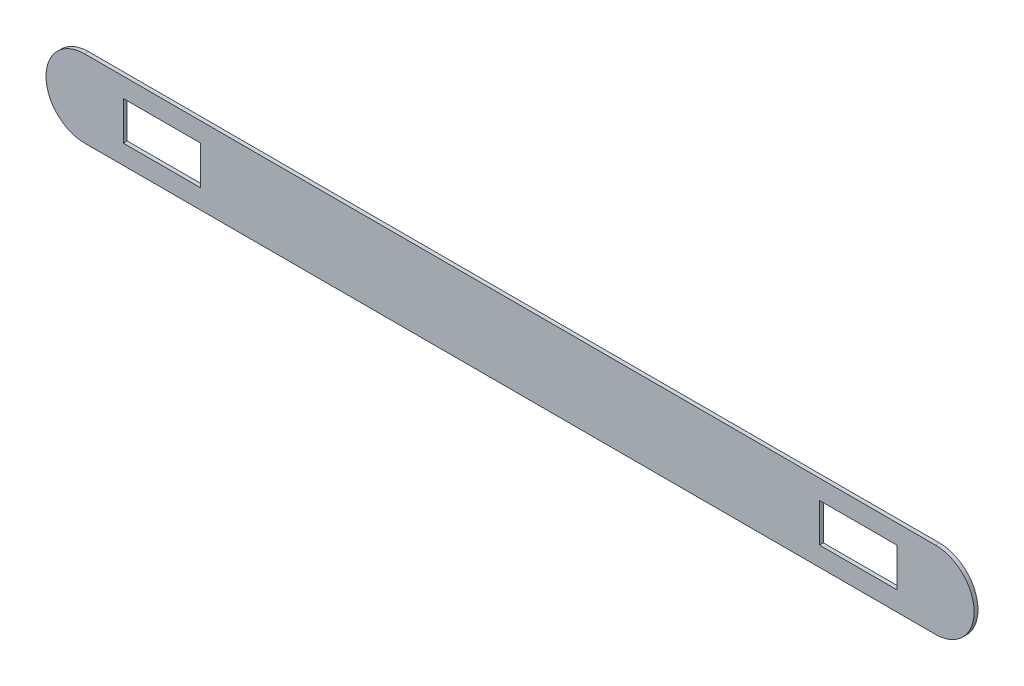
ISO-10303-21;
HEADER;
FILE_DESCRIPTION(('STEP AP214'),'2;1');
FILE_NAME('part.step','',(''),(''),'','','');
FILE_SCHEMA(('AUTOMOTIVE_DESIGN { 1 0 10303 214 1 1 1 1 }'));
ENDSEC;
DATA;
#1=APPLICATION_CONTEXT('core data for automotive mechanical design processes');
#2=APPLICATION_PROTOCOL_DEFINITION('international standard','automotive_design',2000,#1);
#3=PRODUCT_CONTEXT('',#1,'mechanical');
#4=PRODUCT('Part','Part','',(#3));
#5=PRODUCT_RELATED_PRODUCT_CATEGORY('part','',(#4));
#6=PRODUCT_DEFINITION_FORMATION('','',#4);
#7=PRODUCT_DEFINITION_CONTEXT('part definition',#1,'design');
#8=PRODUCT_DEFINITION('design','',#6,#7);
#9=PRODUCT_DEFINITION_SHAPE('','',#8);
#10=(LENGTH_UNIT() NAMED_UNIT(*) SI_UNIT(.MILLI.,.METRE.));
#11=(NAMED_UNIT(*) PLANE_ANGLE_UNIT() SI_UNIT($,.RADIAN.));
#12=(NAMED_UNIT(*) SI_UNIT($,.STERADIAN.) SOLID_ANGLE_UNIT());
#13=UNCERTAINTY_MEASURE_WITH_UNIT(LENGTH_MEASURE(1.E-05),#10,'distance_accuracy_value','');
#14=(GEOMETRIC_REPRESENTATION_CONTEXT(3) GLOBAL_UNCERTAINTY_ASSIGNED_CONTEXT((#13)) GLOBAL_UNIT_ASSIGNED_CONTEXT((#10,
#11,#12)) REPRESENTATION_CONTEXT('',''));
#15=CARTESIAN_POINT('',(0.,0.,0.));
#16=DIRECTION('',(0.,0.,1.));
#17=DIRECTION('',(1.,0.,0.));
#18=AXIS2_PLACEMENT_3D('',#15,#16,#17);
#19=CARTESIAN_POINT('',(-502.733741957931,0.,0.));
#20=DIRECTION('',(0.,0.,1.));
#21=DIRECTION('',(1.,0.,0.));
#22=AXIS2_PLACEMENT_3D('',#19,#20,#21);
#23=PLANE('',#22);
#24=DIRECTION('',(-1.,0.,0.));
#25=VECTOR('',#24,1.);
#26=CARTESIAN_POINT('',(-502.733741957931,25.,0.));
#27=LINE('',#26,#25);
#28=CARTESIAN_POINT('',(-352.733741957931,25.,0.));
#29=VERTEX_POINT('',#28);
#30=CARTESIAN_POINT('',(-452.733741957932,25.,0.));
#31=VERTEX_POINT('',#30);
#32=EDGE_CURVE('E185',#29,#31,#27,.T.);
#33=ORIENTED_EDGE('',*,*,#32,.T.);
#34=DIRECTION('',(0.,-1.,0.));
#35=VECTOR('',#34,1.);
#36=CARTESIAN_POINT('',(-452.733741957932,0.,0.));
#37=LINE('',#36,#35);
#38=CARTESIAN_POINT('',(-452.733741957932,-25.,0.));
#39=VERTEX_POINT('',#38);
#40=EDGE_CURVE('E188',#31,#39,#37,.T.);
#41=ORIENTED_EDGE('',*,*,#40,.T.);
#42=DIRECTION('',(1.,0.,0.));
#43=VECTOR('',#42,1.);
#44=CARTESIAN_POINT('',(-502.733741957931,-25.,0.));
#45=LINE('',#44,#43);
#46=CARTESIAN_POINT('',(-352.733741957931,-25.,0.));
#47=VERTEX_POINT('',#46);
#48=EDGE_CURVE('E182',#39,#47,#45,.T.);
#49=ORIENTED_EDGE('',*,*,#48,.T.);
#50=DIRECTION('',(0.,1.,0.));
#51=VECTOR('',#50,1.);
#52=CARTESIAN_POINT('',(-352.733741957931,0.,0.));
#53=LINE('',#52,#51);
#54=EDGE_CURVE('E127',#47,#29,#53,.T.);
#55=ORIENTED_EDGE('',*,*,#54,.T.);
#56=EDGE_LOOP('',(#33,#41,#49,#55));
#57=FACE_BOUND('',#56,.T.);
#58=DIRECTION('',(-1.,0.,0.));
#59=VECTOR('',#58,1.);
#60=CARTESIAN_POINT('',(-502.733741957931,25.0000000000004,0.));
#61=LINE('',#60,#59);
#62=CARTESIAN_POINT('',(547.266258042068,25.,0.));
#63=VERTEX_POINT('',#62);
#64=CARTESIAN_POINT('',(447.266258042068,25.,0.));
#65=VERTEX_POINT('',#64);
#66=EDGE_CURVE('E176',#63,#65,#61,.T.);
#67=ORIENTED_EDGE('',*,*,#66,.T.);
#68=DIRECTION('',(0.,-1.,0.));
#69=VECTOR('',#68,1.);
#70=CARTESIAN_POINT('',(447.266258042068,0.,0.));
#71=LINE('',#70,#69);
#72=CARTESIAN_POINT('',(447.266258042068,-25.,0.));
#73=VERTEX_POINT('',#72);
#74=EDGE_CURVE('E179',#65,#73,#71,.T.);
#75=ORIENTED_EDGE('',*,*,#74,.T.);
#76=DIRECTION('',(1.,0.,0.));
#77=VECTOR('',#76,1.);
#78=CARTESIAN_POINT('',(-502.733741957931,-25.,0.));
#79=LINE('',#78,#77);
#80=CARTESIAN_POINT('',(547.266258042068,-25.,0.));
#81=VERTEX_POINT('',#80);
#82=EDGE_CURVE('E150',#73,#81,#79,.T.);
#83=ORIENTED_EDGE('',*,*,#82,.T.);
#84=DIRECTION('',(0.,1.,0.));
#85=VECTOR('',#84,1.);
#86=CARTESIAN_POINT('',(547.266258042068,0.,0.));
#87=LINE('',#86,#85);
#88=EDGE_CURVE('E173',#81,#63,#87,.T.);
#89=ORIENTED_EDGE('',*,*,#88,.T.);
#90=EDGE_LOOP('',(#67,#75,#83,#89));
#91=FACE_BOUND('',#90,.T.);
#92=CARTESIAN_POINT('',(-502.733741957931,0.,0.));
#93=DIRECTION('',(0.,0.,1.));
#94=DIRECTION('',(1.,0.,0.));
#95=AXIS2_PLACEMENT_3D('',#92,#93,#94);
#96=CIRCLE('',#95,50.);
#97=CARTESIAN_POINT('',(-502.733741957931,50.,0.));
#98=VERTEX_POINT('',#97);
#99=CARTESIAN_POINT('',(-502.733741957931,-50.,0.));
#100=VERTEX_POINT('',#99);
#101=EDGE_CURVE('E212',#98,#100,#96,.T.);
#102=ORIENTED_EDGE('',*,*,#101,.F.);
#103=DIRECTION('',(-1.,0.,0.));
#104=VECTOR('',#103,1.);
#105=CARTESIAN_POINT('',(-502.733741957931,50.,0.));
#106=LINE('',#105,#104);
#107=CARTESIAN_POINT('',(597.266258042068,50.,0.));
#108=VERTEX_POINT('',#107);
#109=EDGE_CURVE('E197',#108,#98,#106,.T.);
#110=ORIENTED_EDGE('',*,*,#109,.F.);
#111=CARTESIAN_POINT('',(597.266258042068,0.,0.));
#112=DIRECTION('',(0.,0.,1.));
#113=DIRECTION('',(1.,0.,0.));
#114=AXIS2_PLACEMENT_3D('',#111,#112,#113);
#115=CIRCLE('',#114,50.);
#116=CARTESIAN_POINT('',(597.266258042068,-50.,0.));
#117=VERTEX_POINT('',#116);
#118=EDGE_CURVE('E206',#117,#108,#115,.T.);
#119=ORIENTED_EDGE('',*,*,#118,.F.);
#120=DIRECTION('',(1.,0.,0.));
#121=VECTOR('',#120,1.);
#122=CARTESIAN_POINT('',(-502.733741957931,-50.,0.));
#123=LINE('',#122,#121);
#124=EDGE_CURVE('E11',#100,#117,#123,.T.);
#125=ORIENTED_EDGE('',*,*,#124,.F.);
#126=EDGE_LOOP('',(#102,#110,#119,#125));
#127=FACE_BOUND('',#126,.T.);
#128=ADVANCED_FACE('F32',(#57,#91,#127),#23,.F.);
#129=CARTESIAN_POINT('',(-502.733741957931,-50.,80.));
#130=DIRECTION('',(0.,1.,0.));
#131=DIRECTION('',(0.,0.,1.));
#132=AXIS2_PLACEMENT_3D('',#129,#130,#131);
#133=PLANE('',#132);
#134=DIRECTION('',(0.,0.,-1.));
#135=VECTOR('',#134,1.);
#136=CARTESIAN_POINT('',(597.266258042068,-50.,80.));
#137=LINE('',#136,#135);
#138=CARTESIAN_POINT('',(597.266258042068,-50.,5.));
#139=VERTEX_POINT('',#138);
#140=EDGE_CURVE('E207',#139,#117,#137,.T.);
#141=ORIENTED_EDGE('',*,*,#140,.F.);
#142=DIRECTION('',(-1.,0.,0.));
#143=VECTOR('',#142,1.);
#144=CARTESIAN_POINT('',(-502.733741957931,-50.,5.));
#145=LINE('',#144,#143);
#146=CARTESIAN_POINT('',(-502.733741957931,-50.,5.));
#147=VERTEX_POINT('',#146);
#148=EDGE_CURVE('E203',#139,#147,#145,.T.);
#149=ORIENTED_EDGE('',*,*,#148,.T.);
#150=DIRECTION('',(0.,0.,-1.));
#151=VECTOR('',#150,1.);
#152=CARTESIAN_POINT('',(-502.733741957931,-50.,80.));
#153=LINE('',#152,#151);
#154=EDGE_CURVE('E210',#147,#100,#153,.T.);
#155=ORIENTED_EDGE('',*,*,#154,.T.);
#156=ORIENTED_EDGE('',*,*,#124,.T.);
#157=EDGE_LOOP('',(#141,#149,#155,#156));
#158=FACE_BOUND('',#157,.T.);
#159=ADVANCED_FACE('F222',(#158),#133,.F.);
#160=CARTESIAN_POINT('',(-502.733741957931,0.,80.));
#161=DIRECTION('',(0.,0.,-1.));
#162=DIRECTION('',(-1.,0.,0.));
#163=AXIS2_PLACEMENT_3D('',#160,#161,#162);
#164=CYLINDRICAL_SURFACE('',#163,50.);
#165=CARTESIAN_POINT('',(-502.733741957931,0.,5.));
#166=DIRECTION('',(0.,0.,1.));
#167=DIRECTION('',(1.,0.,0.));
#168=AXIS2_PLACEMENT_3D('',#165,#166,#167);
#169=CIRCLE('',#168,50.);
#170=CARTESIAN_POINT('',(-502.733741957931,50.,5.));
#171=VERTEX_POINT('',#170);
#172=EDGE_CURVE('E36',#171,#147,#169,.T.);
#173=ORIENTED_EDGE('',*,*,#172,.F.);
#174=DIRECTION('',(0.,0.,-1.));
#175=VECTOR('',#174,1.);
#176=CARTESIAN_POINT('',(-502.733741957931,50.,80.));
#177=LINE('',#176,#175);
#178=EDGE_CURVE('E194',#171,#98,#177,.T.);
#179=ORIENTED_EDGE('',*,*,#178,.T.);
#180=ORIENTED_EDGE('',*,*,#101,.T.);
#181=ORIENTED_EDGE('',*,*,#154,.F.);
#182=EDGE_LOOP('',(#173,#179,#180,#181));
#183=FACE_BOUND('',#182,.T.);
#184=ADVANCED_FACE('F225',(#183),#164,.T.);
#185=CARTESIAN_POINT('',(597.266258042068,0.,80.));
#186=DIRECTION('',(0.,0.,-1.));
#187=DIRECTION('',(-1.,0.,0.));
#188=AXIS2_PLACEMENT_3D('',#185,#186,#187);
#189=CYLINDRICAL_SURFACE('',#188,50.);
#190=ORIENTED_EDGE('',*,*,#118,.T.);
#191=DIRECTION('',(0.,0.,-1.));
#192=VECTOR('',#191,1.);
#193=CARTESIAN_POINT('',(597.266258042068,50.,80.));
#194=LINE('',#193,#192);
#195=CARTESIAN_POINT('',(597.266258042068,50.,5.));
#196=VERTEX_POINT('',#195);
#197=EDGE_CURVE('E191',#196,#108,#194,.T.);
#198=ORIENTED_EDGE('',*,*,#197,.F.);
#199=CARTESIAN_POINT('',(597.266258042068,0.,5.));
#200=DIRECTION('',(0.,0.,1.));
#201=DIRECTION('',(1.,0.,0.));
#202=AXIS2_PLACEMENT_3D('',#199,#200,#201);
#203=CIRCLE('',#202,50.);
#204=EDGE_CURVE('E209',#139,#196,#203,.T.);
#205=ORIENTED_EDGE('',*,*,#204,.F.);
#206=ORIENTED_EDGE('',*,*,#140,.T.);
#207=EDGE_LOOP('',(#190,#198,#205,#206));
#208=FACE_BOUND('',#207,.T.);
#209=ADVANCED_FACE('F227',(#208),#189,.T.);
#210=CARTESIAN_POINT('',(597.266258042068,-45.,5.));
#211=DIRECTION('',(0.,0.,1.));
#212=DIRECTION('',(1.,0.,0.));
#213=AXIS2_PLACEMENT_3D('',#210,#211,#212);
#214=PLANE('',#213);
#215=DIRECTION('',(0.,-1.,0.));
#216=VECTOR('',#215,1.);
#217=CARTESIAN_POINT('',(-452.733741957932,25.,5.));
#218=LINE('',#217,#216);
#219=CARTESIAN_POINT('',(-452.733741957932,25.,5.));
#220=VERTEX_POINT('',#219);
#221=CARTESIAN_POINT('',(-452.733741957931,-25.,5.));
#222=VERTEX_POINT('',#221);
#223=EDGE_CURVE('E139',#220,#222,#218,.T.);
#224=ORIENTED_EDGE('',*,*,#223,.F.);
#225=DIRECTION('',(-1.,0.,0.));
#226=VECTOR('',#225,1.);
#227=CARTESIAN_POINT('',(-452.733741957932,25.,5.));
#228=LINE('',#227,#226);
#229=CARTESIAN_POINT('',(-352.733741957931,25.,5.));
#230=VERTEX_POINT('',#229);
#231=EDGE_CURVE('E143',#230,#220,#228,.T.);
#232=ORIENTED_EDGE('',*,*,#231,.F.);
#233=DIRECTION('',(0.,1.,0.));
#234=VECTOR('',#233,1.);
#235=CARTESIAN_POINT('',(-352.733741957931,25.,5.));
#236=LINE('',#235,#234);
#237=CARTESIAN_POINT('',(-352.733741957931,-25.,5.));
#238=VERTEX_POINT('',#237);
#239=EDGE_CURVE('E124',#238,#230,#236,.T.);
#240=ORIENTED_EDGE('',*,*,#239,.F.);
#241=DIRECTION('',(1.,0.,0.));
#242=VECTOR('',#241,1.);
#243=CARTESIAN_POINT('',(-452.733741957932,-25.,5.));
#244=LINE('',#243,#242);
#245=EDGE_CURVE('E134',#222,#238,#244,.T.);
#246=ORIENTED_EDGE('',*,*,#245,.F.);
#247=EDGE_LOOP('',(#224,#232,#240,#246));
#248=FACE_BOUND('',#247,.T.);
#249=DIRECTION('',(0.,-1.,0.));
#250=VECTOR('',#249,1.);
#251=CARTESIAN_POINT('',(447.266258042068,25.,5.));
#252=LINE('',#251,#250);
#253=CARTESIAN_POINT('',(447.266258042068,25.,5.));
#254=VERTEX_POINT('',#253);
#255=CARTESIAN_POINT('',(447.266258042068,-25.,5.));
#256=VERTEX_POINT('',#255);
#257=EDGE_CURVE('E153',#254,#256,#252,.T.);
#258=ORIENTED_EDGE('',*,*,#257,.F.);
#259=DIRECTION('',(-1.,0.,0.));
#260=VECTOR('',#259,1.);
#261=CARTESIAN_POINT('',(447.266258042068,25.,5.));
#262=LINE('',#261,#260);
#263=CARTESIAN_POINT('',(547.266258042068,25.,5.));
#264=VERTEX_POINT('',#263);
#265=EDGE_CURVE('E160',#264,#254,#262,.T.);
#266=ORIENTED_EDGE('',*,*,#265,.F.);
#267=DIRECTION('',(0.,1.,0.));
#268=VECTOR('',#267,1.);
#269=CARTESIAN_POINT('',(547.266258042068,25.,5.));
#270=LINE('',#269,#268);
#271=CARTESIAN_POINT('',(547.266258042068,-25.,5.));
#272=VERTEX_POINT('',#271);
#273=EDGE_CURVE('E157',#272,#264,#270,.T.);
#274=ORIENTED_EDGE('',*,*,#273,.F.);
#275=DIRECTION('',(1.,0.,0.));
#276=VECTOR('',#275,1.);
#277=CARTESIAN_POINT('',(447.266258042068,-25.,5.));
#278=LINE('',#277,#276);
#279=EDGE_CURVE('E155',#256,#272,#278,.T.);
#280=ORIENTED_EDGE('',*,*,#279,.F.);
#281=EDGE_LOOP('',(#258,#266,#274,#280));
#282=FACE_BOUND('',#281,.T.);
#283=ORIENTED_EDGE('',*,*,#204,.T.);
#284=DIRECTION('',(1.,0.,0.));
#285=VECTOR('',#284,1.);
#286=CARTESIAN_POINT('',(-502.733741957931,50.,5.));
#287=LINE('',#286,#285);
#288=EDGE_CURVE('E200',#171,#196,#287,.T.);
#289=ORIENTED_EDGE('',*,*,#288,.F.);
#290=ORIENTED_EDGE('',*,*,#172,.T.);
#291=ORIENTED_EDGE('',*,*,#148,.F.);
#292=EDGE_LOOP('',(#283,#289,#290,#291));
#293=FACE_BOUND('',#292,.T.);
#294=ADVANCED_FACE('F34',(#248,#282,#293),#214,.T.);
#295=CARTESIAN_POINT('',(-502.733741957931,50.,80.));
#296=DIRECTION('',(0.,-1.,0.));
#297=DIRECTION('',(0.,0.,-1.));
#298=AXIS2_PLACEMENT_3D('',#295,#296,#297);
#299=PLANE('',#298);
#300=ORIENTED_EDGE('',*,*,#178,.F.);
#301=ORIENTED_EDGE('',*,*,#288,.T.);
#302=ORIENTED_EDGE('',*,*,#197,.T.);
#303=ORIENTED_EDGE('',*,*,#109,.T.);
#304=EDGE_LOOP('',(#300,#301,#302,#303));
#305=FACE_BOUND('',#304,.T.);
#306=ADVANCED_FACE('F245',(#305),#299,.F.);
#307=CARTESIAN_POINT('',(447.266258042068,25.,-5.));
#308=DIRECTION('',(-1.,0.,0.));
#309=DIRECTION('',(0.,0.,1.));
#310=AXIS2_PLACEMENT_3D('',#307,#308,#309);
#311=PLANE('',#310);
#312=DIRECTION('',(0.,0.,1.));
#313=VECTOR('',#312,1.);
#314=CARTESIAN_POINT('',(447.266258042068,25.,-5.));
#315=LINE('',#314,#313);
#316=EDGE_CURVE('E164',#65,#254,#315,.T.);
#317=ORIENTED_EDGE('',*,*,#316,.T.);
#318=ORIENTED_EDGE('',*,*,#257,.T.);
#319=DIRECTION('',(0.,0.,1.));
#320=VECTOR('',#319,1.);
#321=CARTESIAN_POINT('',(447.266258042068,-25.,-5.));
#322=LINE('',#321,#320);
#323=EDGE_CURVE('E163',#73,#256,#322,.T.);
#324=ORIENTED_EDGE('',*,*,#323,.F.);
#325=ORIENTED_EDGE('',*,*,#74,.F.);
#326=EDGE_LOOP('',(#317,#318,#324,#325));
#327=FACE_BOUND('',#326,.T.);
#328=ADVANCED_FACE('F248',(#327),#311,.F.);
#329=CARTESIAN_POINT('',(447.266258042068,25.,-5.));
#330=DIRECTION('',(0.,1.,0.));
#331=DIRECTION('',(-1.,0.,0.));
#332=AXIS2_PLACEMENT_3D('',#329,#330,#331);
#333=PLANE('',#332);
#334=DIRECTION('',(0.,0.,1.));
#335=VECTOR('',#334,1.);
#336=CARTESIAN_POINT('',(547.266258042068,25.,-5.));
#337=LINE('',#336,#335);
#338=EDGE_CURVE('E166',#63,#264,#337,.T.);
#339=ORIENTED_EDGE('',*,*,#338,.T.);
#340=ORIENTED_EDGE('',*,*,#265,.T.);
#341=ORIENTED_EDGE('',*,*,#316,.F.);
#342=ORIENTED_EDGE('',*,*,#66,.F.);
#343=EDGE_LOOP('',(#339,#340,#341,#342));
#344=FACE_BOUND('',#343,.T.);
#345=ADVANCED_FACE('F254',(#344),#333,.F.);
#346=CARTESIAN_POINT('',(547.266258042068,25.,-5.));
#347=DIRECTION('',(1.,0.,0.));
#348=DIRECTION('',(0.,0.,-1.));
#349=AXIS2_PLACEMENT_3D('',#346,#347,#348);
#350=PLANE('',#349);
#351=DIRECTION('',(0.,0.,1.));
#352=VECTOR('',#351,1.);
#353=CARTESIAN_POINT('',(547.266258042068,-25.,-5.));
#354=LINE('',#353,#352);
#355=EDGE_CURVE('E56',#81,#272,#354,.T.);
#356=ORIENTED_EDGE('',*,*,#355,.T.);
#357=ORIENTED_EDGE('',*,*,#273,.T.);
#358=ORIENTED_EDGE('',*,*,#338,.F.);
#359=ORIENTED_EDGE('',*,*,#88,.F.);
#360=EDGE_LOOP('',(#356,#357,#358,#359));
#361=FACE_BOUND('',#360,.T.);
#362=ADVANCED_FACE('F262',(#361),#350,.F.);
#363=CARTESIAN_POINT('',(447.266258042068,-25.,-5.));
#364=DIRECTION('',(0.,-1.,0.));
#365=DIRECTION('',(0.,0.,-1.));
#366=AXIS2_PLACEMENT_3D('',#363,#364,#365);
#367=PLANE('',#366);
#368=ORIENTED_EDGE('',*,*,#323,.T.);
#369=ORIENTED_EDGE('',*,*,#279,.T.);
#370=ORIENTED_EDGE('',*,*,#355,.F.);
#371=ORIENTED_EDGE('',*,*,#82,.F.);
#372=EDGE_LOOP('',(#368,#369,#370,#371));
#373=FACE_BOUND('',#372,.T.);
#374=ADVANCED_FACE('F258',(#373),#367,.F.);
#375=CARTESIAN_POINT('',(-452.733741957932,25.,-5.));
#376=DIRECTION('',(-1.,0.,0.));
#377=DIRECTION('',(0.,0.,1.));
#378=AXIS2_PLACEMENT_3D('',#375,#376,#377);
#379=PLANE('',#378);
#380=DIRECTION('',(0.,0.,1.));
#381=VECTOR('',#380,1.);
#382=CARTESIAN_POINT('',(-452.733741957932,25.,-5.));
#383=LINE('',#382,#381);
#384=EDGE_CURVE('E148',#31,#220,#383,.T.);
#385=ORIENTED_EDGE('',*,*,#384,.T.);
#386=ORIENTED_EDGE('',*,*,#223,.T.);
#387=DIRECTION('',(0.,0.,1.));
#388=VECTOR('',#387,1.);
#389=CARTESIAN_POINT('',(-452.733741957932,-25.,-5.));
#390=LINE('',#389,#388);
#391=EDGE_CURVE('E130',#39,#222,#390,.T.);
#392=ORIENTED_EDGE('',*,*,#391,.F.);
#393=ORIENTED_EDGE('',*,*,#40,.F.);
#394=EDGE_LOOP('',(#385,#386,#392,#393));
#395=FACE_BOUND('',#394,.T.);
#396=ADVANCED_FACE('F261',(#395),#379,.F.);
#397=CARTESIAN_POINT('',(-452.733741957932,25.,-5.));
#398=DIRECTION('',(0.,1.,0.));
#399=DIRECTION('',(0.,0.,1.));
#400=AXIS2_PLACEMENT_3D('',#397,#398,#399);
#401=PLANE('',#400);
#402=DIRECTION('',(0.,0.,1.));
#403=VECTOR('',#402,1.);
#404=CARTESIAN_POINT('',(-352.733741957931,25.,-5.));
#405=LINE('',#404,#403);
#406=EDGE_CURVE('E129',#29,#230,#405,.T.);
#407=ORIENTED_EDGE('',*,*,#406,.T.);
#408=ORIENTED_EDGE('',*,*,#231,.T.);
#409=ORIENTED_EDGE('',*,*,#384,.F.);
#410=ORIENTED_EDGE('',*,*,#32,.F.);
#411=EDGE_LOOP('',(#407,#408,#409,#410));
#412=FACE_BOUND('',#411,.T.);
#413=ADVANCED_FACE('F271',(#412),#401,.F.);
#414=CARTESIAN_POINT('',(-352.733741957931,25.,-5.));
#415=DIRECTION('',(1.,0.,0.));
#416=DIRECTION('',(0.,0.,-1.));
#417=AXIS2_PLACEMENT_3D('',#414,#415,#416);
#418=PLANE('',#417);
#419=DIRECTION('',(0.,0.,1.));
#420=VECTOR('',#419,1.);
#421=CARTESIAN_POINT('',(-352.733741957931,-25.,-5.));
#422=LINE('',#421,#420);
#423=EDGE_CURVE('E48',#47,#238,#422,.T.);
#424=ORIENTED_EDGE('',*,*,#423,.T.);
#425=ORIENTED_EDGE('',*,*,#239,.T.);
#426=ORIENTED_EDGE('',*,*,#406,.F.);
#427=ORIENTED_EDGE('',*,*,#54,.F.);
#428=EDGE_LOOP('',(#424,#425,#426,#427));
#429=FACE_BOUND('',#428,.T.);
#430=ADVANCED_FACE('F121',(#429),#418,.F.);
#431=CARTESIAN_POINT('',(-452.733741957932,-25.,-5.));
#432=DIRECTION('',(0.,-1.,0.));
#433=DIRECTION('',(0.,0.,-1.));
#434=AXIS2_PLACEMENT_3D('',#431,#432,#433);
#435=PLANE('',#434);
#436=ORIENTED_EDGE('',*,*,#391,.T.);
#437=ORIENTED_EDGE('',*,*,#245,.T.);
#438=ORIENTED_EDGE('',*,*,#423,.F.);
#439=ORIENTED_EDGE('',*,*,#48,.F.);
#440=EDGE_LOOP('',(#436,#437,#438,#439));
#441=FACE_BOUND('',#440,.T.);
#442=ADVANCED_FACE('F135',(#441),#435,.F.);
#443=CLOSED_SHELL('',(#128,#159,#184,#209,#294,#306,#328,#345,#362,#374,#396,#413,#430,#442));
#444=MANIFOLD_SOLID_BREP('B2',#443);
#445=ADVANCED_BREP_SHAPE_REPRESENTATION('',(#18,#444),#14);
#446=SHAPE_DEFINITION_REPRESENTATION(#9,#445);
ENDSEC;
END-ISO-10303-21;
